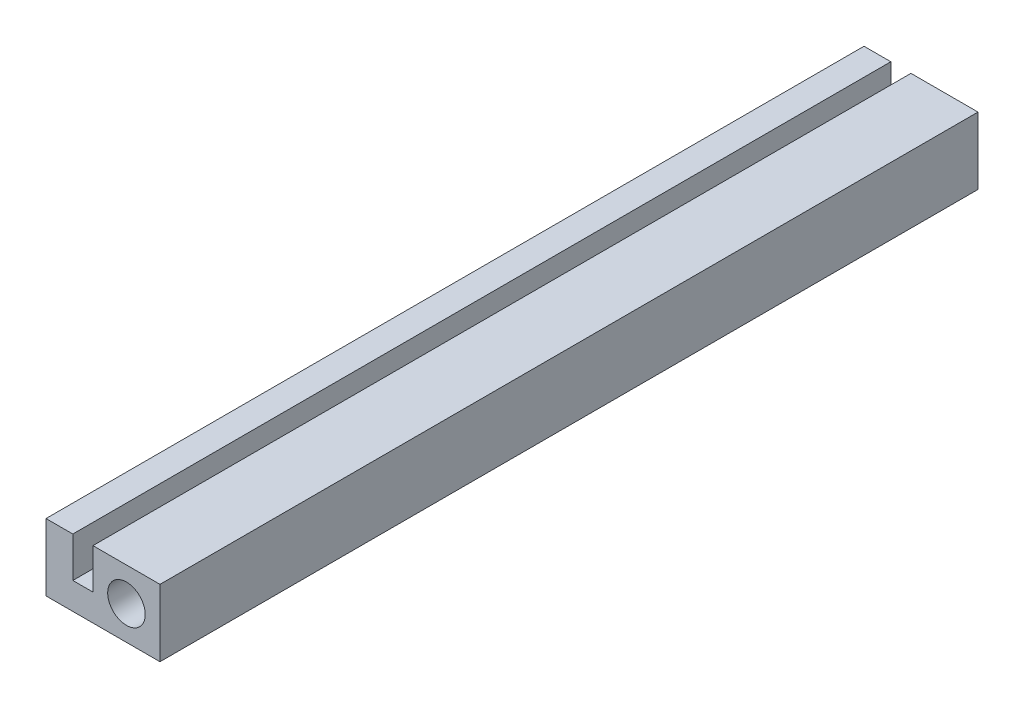
ISO-10303-21;
HEADER;
FILE_DESCRIPTION(('STEP AP214'),'2;1');
FILE_NAME('part.step','',(''),(''),'','','');
FILE_SCHEMA(('AUTOMOTIVE_DESIGN { 1 0 10303 214 1 1 1 1 }'));
ENDSEC;
DATA;
#1=APPLICATION_CONTEXT('core data for automotive mechanical design processes');
#2=APPLICATION_PROTOCOL_DEFINITION('international standard','automotive_design',2000,#1);
#3=PRODUCT_CONTEXT('',#1,'mechanical');
#4=PRODUCT('Part','Part','',(#3));
#5=PRODUCT_RELATED_PRODUCT_CATEGORY('part','',(#4));
#6=PRODUCT_DEFINITION_FORMATION('','',#4);
#7=PRODUCT_DEFINITION_CONTEXT('part definition',#1,'design');
#8=PRODUCT_DEFINITION('design','',#6,#7);
#9=PRODUCT_DEFINITION_SHAPE('','',#8);
#10=(LENGTH_UNIT() NAMED_UNIT(*) SI_UNIT(.MILLI.,.METRE.));
#11=(NAMED_UNIT(*) PLANE_ANGLE_UNIT() SI_UNIT($,.RADIAN.));
#12=(NAMED_UNIT(*) SI_UNIT($,.STERADIAN.) SOLID_ANGLE_UNIT());
#13=UNCERTAINTY_MEASURE_WITH_UNIT(LENGTH_MEASURE(1.E-05),#10,'distance_accuracy_value','');
#14=(GEOMETRIC_REPRESENTATION_CONTEXT(3) GLOBAL_UNCERTAINTY_ASSIGNED_CONTEXT((#13)) GLOBAL_UNIT_ASSIGNED_CONTEXT((#10,
#11,#12)) REPRESENTATION_CONTEXT('',''));
#15=CARTESIAN_POINT('',(0.,0.,0.));
#16=DIRECTION('',(0.,0.,1.));
#17=DIRECTION('',(1.,0.,0.));
#18=AXIS2_PLACEMENT_3D('',#15,#16,#17);
#19=CARTESIAN_POINT('',(0.,0.,122.));
#20=DIRECTION('',(0.,0.,1.));
#21=DIRECTION('',(1.,0.,0.));
#22=AXIS2_PLACEMENT_3D('',#19,#20,#21);
#23=PLANE('',#22);
#24=DIRECTION('',(-1.,0.,0.));
#25=VECTOR('',#24,1.);
#26=CARTESIAN_POINT('',(-2.6767397699127,2.93705011184856,122.));
#27=LINE('',#26,#25);
#28=CARTESIAN_POINT('',(-2.6767397699127,2.93705011184856,122.));
#29=VERTEX_POINT('',#28);
#30=CARTESIAN_POINT('',(-6.6767397699127,2.93705011184857,122.));
#31=VERTEX_POINT('',#30);
#32=EDGE_CURVE('E151',#29,#31,#27,.T.);
#33=ORIENTED_EDGE('',*,*,#32,.T.);
#34=DIRECTION('',(0.,-1.,0.));
#35=VECTOR('',#34,1.);
#36=CARTESIAN_POINT('',(-6.6767397699127,2.93705011184857,122.));
#37=LINE('',#36,#35);
#38=CARTESIAN_POINT('',(-6.6767397699127,-7.06294988815141,122.));
#39=VERTEX_POINT('',#38);
#40=EDGE_CURVE('E99',#31,#39,#37,.T.);
#41=ORIENTED_EDGE('',*,*,#40,.T.);
#42=DIRECTION('',(1.,0.,0.));
#43=VECTOR('',#42,1.);
#44=CARTESIAN_POINT('',(-6.6767397699127,-7.06294988815141,122.));
#45=LINE('',#44,#43);
#46=CARTESIAN_POINT('',(10.3232602300873,-7.06294988815139,122.));
#47=VERTEX_POINT('',#46);
#48=EDGE_CURVE('E166',#39,#47,#45,.T.);
#49=ORIENTED_EDGE('',*,*,#48,.T.);
#50=DIRECTION('',(0.,1.,0.));
#51=VECTOR('',#50,1.);
#52=CARTESIAN_POINT('',(10.3232602300873,-7.06294988815139,122.));
#53=LINE('',#52,#51);
#54=CARTESIAN_POINT('',(10.3232602300873,2.93705011184856,122.));
#55=VERTEX_POINT('',#54);
#56=EDGE_CURVE('E179',#47,#55,#53,.T.);
#57=ORIENTED_EDGE('',*,*,#56,.T.);
#58=DIRECTION('',(-1.,0.,0.));
#59=VECTOR('',#58,1.);
#60=CARTESIAN_POINT('',(10.3232602300873,2.93705011184856,122.));
#61=LINE('',#60,#59);
#62=CARTESIAN_POINT('',(0.323260230087299,2.93705011184856,122.));
#63=VERTEX_POINT('',#62);
#64=EDGE_CURVE('E118',#55,#63,#61,.T.);
#65=ORIENTED_EDGE('',*,*,#64,.T.);
#66=DIRECTION('',(0.,-1.,0.));
#67=VECTOR('',#66,1.);
#68=CARTESIAN_POINT('',(0.323260230087299,2.93705011184856,122.));
#69=LINE('',#68,#67);
#70=CARTESIAN_POINT('',(0.323260230087299,-3.06294988815136,122.));
#71=VERTEX_POINT('',#70);
#72=EDGE_CURVE('E112',#63,#71,#69,.T.);
#73=ORIENTED_EDGE('',*,*,#72,.T.);
#74=DIRECTION('',(-1.,0.,0.));
#75=VECTOR('',#74,1.);
#76=CARTESIAN_POINT('',(0.323260230087299,-3.06294988815136,122.));
#77=LINE('',#76,#75);
#78=CARTESIAN_POINT('',(-2.6767397699127,-3.06294988815136,122.));
#79=VERTEX_POINT('',#78);
#80=EDGE_CURVE('E116',#71,#79,#77,.T.);
#81=ORIENTED_EDGE('',*,*,#80,.T.);
#82=DIRECTION('',(0.,1.,0.));
#83=VECTOR('',#82,1.);
#84=CARTESIAN_POINT('',(-2.6767397699127,-3.06294988815136,122.));
#85=LINE('',#84,#83);
#86=EDGE_CURVE('E56',#79,#29,#85,.T.);
#87=ORIENTED_EDGE('',*,*,#86,.T.);
#88=EDGE_LOOP('',(#33,#41,#49,#57,#65,#73,#81,#87));
#89=FACE_BOUND('',#88,.T.);
#90=CARTESIAN_POINT('',(5.3232602300873,-2.06294988815142,122.));
#91=DIRECTION('',(0.,0.,1.));
#92=DIRECTION('',(1.,0.,0.));
#93=AXIS2_PLACEMENT_3D('',#90,#91,#92);
#94=CIRCLE('',#93,2.8);
#95=CARTESIAN_POINT('',(8.1232602300873,-2.06294988815142,122.));
#96=VERTEX_POINT('',#95);
#97=EDGE_CURVE('E140',#96,#96,#94,.T.);
#98=ORIENTED_EDGE('',*,*,#97,.F.);
#99=EDGE_LOOP('',(#98));
#100=FACE_BOUND('',#99,.T.);
#101=ADVANCED_FACE('F39',(#89,#100),#23,.T.);
#102=CARTESIAN_POINT('',(0.,0.,0.));
#103=DIRECTION('',(0.,0.,1.));
#104=DIRECTION('',(1.,0.,0.));
#105=AXIS2_PLACEMENT_3D('',#102,#103,#104);
#106=PLANE('',#105);
#107=DIRECTION('',(-1.,0.,0.));
#108=VECTOR('',#107,1.);
#109=CARTESIAN_POINT('',(-2.6767397699127,2.93705011184856,0.));
#110=LINE('',#109,#108);
#111=CARTESIAN_POINT('',(-2.6767397699127,2.93705011184856,0.));
#112=VERTEX_POINT('',#111);
#113=CARTESIAN_POINT('',(-6.6767397699127,2.93705011184857,0.));
#114=VERTEX_POINT('',#113);
#115=EDGE_CURVE('E136',#112,#114,#110,.T.);
#116=ORIENTED_EDGE('',*,*,#115,.F.);
#117=DIRECTION('',(0.,1.,0.));
#118=VECTOR('',#117,1.);
#119=CARTESIAN_POINT('',(-2.6767397699127,-3.06294988815136,0.));
#120=LINE('',#119,#118);
#121=CARTESIAN_POINT('',(-2.6767397699127,-3.06294988815136,0.));
#122=VERTEX_POINT('',#121);
#123=EDGE_CURVE('E91',#122,#112,#120,.T.);
#124=ORIENTED_EDGE('',*,*,#123,.F.);
#125=DIRECTION('',(-1.,0.,0.));
#126=VECTOR('',#125,1.);
#127=CARTESIAN_POINT('',(0.323260230087299,-3.06294988815136,0.));
#128=LINE('',#127,#126);
#129=CARTESIAN_POINT('',(0.323260230087299,-3.06294988815136,0.));
#130=VERTEX_POINT('',#129);
#131=EDGE_CURVE('E85',#130,#122,#128,.T.);
#132=ORIENTED_EDGE('',*,*,#131,.F.);
#133=DIRECTION('',(0.,-1.,0.));
#134=VECTOR('',#133,1.);
#135=CARTESIAN_POINT('',(0.323260230087299,2.93705011184856,0.));
#136=LINE('',#135,#134);
#137=CARTESIAN_POINT('',(0.323260230087299,2.93705011184856,0.));
#138=VERTEX_POINT('',#137);
#139=EDGE_CURVE('E126',#138,#130,#136,.T.);
#140=ORIENTED_EDGE('',*,*,#139,.F.);
#141=DIRECTION('',(-1.,0.,0.));
#142=VECTOR('',#141,1.);
#143=CARTESIAN_POINT('',(10.3232602300873,2.93705011184856,0.));
#144=LINE('',#143,#142);
#145=CARTESIAN_POINT('',(10.3232602300873,2.93705011184856,0.));
#146=VERTEX_POINT('',#145);
#147=EDGE_CURVE('E146',#146,#138,#144,.T.);
#148=ORIENTED_EDGE('',*,*,#147,.F.);
#149=DIRECTION('',(0.,1.,0.));
#150=VECTOR('',#149,1.);
#151=CARTESIAN_POINT('',(10.3232602300873,-7.06294988815139,0.));
#152=LINE('',#151,#150);
#153=CARTESIAN_POINT('',(10.3232602300873,-7.06294988815139,0.));
#154=VERTEX_POINT('',#153);
#155=EDGE_CURVE('E144',#154,#146,#152,.T.);
#156=ORIENTED_EDGE('',*,*,#155,.F.);
#157=DIRECTION('',(1.,0.,0.));
#158=VECTOR('',#157,1.);
#159=CARTESIAN_POINT('',(-6.6767397699127,-7.06294988815141,0.));
#160=LINE('',#159,#158);
#161=CARTESIAN_POINT('',(-6.6767397699127,-7.06294988815141,0.));
#162=VERTEX_POINT('',#161);
#163=EDGE_CURVE('E142',#162,#154,#160,.T.);
#164=ORIENTED_EDGE('',*,*,#163,.F.);
#165=DIRECTION('',(0.,-1.,0.));
#166=VECTOR('',#165,1.);
#167=CARTESIAN_POINT('',(-6.6767397699127,2.93705011184857,0.));
#168=LINE('',#167,#166);
#169=EDGE_CURVE('E139',#114,#162,#168,.T.);
#170=ORIENTED_EDGE('',*,*,#169,.F.);
#171=EDGE_LOOP('',(#116,#124,#132,#140,#148,#156,#164,#170));
#172=FACE_BOUND('',#171,.T.);
#173=CARTESIAN_POINT('',(5.3232602300873,-2.06294988815142,0.));
#174=DIRECTION('',(0.,0.,1.));
#175=DIRECTION('',(1.,0.,0.));
#176=AXIS2_PLACEMENT_3D('',#173,#174,#175);
#177=CIRCLE('',#176,2.8);
#178=CARTESIAN_POINT('',(8.1232602300873,-2.06294988815142,0.));
#179=VERTEX_POINT('',#178);
#180=EDGE_CURVE('E185',#179,#179,#177,.T.);
#181=ORIENTED_EDGE('',*,*,#180,.T.);
#182=EDGE_LOOP('',(#181));
#183=FACE_BOUND('',#182,.T.);
#184=ADVANCED_FACE('F170',(#172,#183),#106,.F.);
#185=CARTESIAN_POINT('',(-2.6767397699127,2.93705011184856,122.));
#186=DIRECTION('',(0.,-1.,0.));
#187=DIRECTION('',(1.,0.,0.));
#188=AXIS2_PLACEMENT_3D('',#185,#186,#187);
#189=PLANE('',#188);
#190=ORIENTED_EDGE('',*,*,#115,.T.);
#191=DIRECTION('',(0.,0.,-1.));
#192=VECTOR('',#191,1.);
#193=CARTESIAN_POINT('',(-6.6767397699127,2.93705011184857,122.));
#194=LINE('',#193,#192);
#195=EDGE_CURVE('E11',#31,#114,#194,.T.);
#196=ORIENTED_EDGE('',*,*,#195,.F.);
#197=ORIENTED_EDGE('',*,*,#32,.F.);
#198=DIRECTION('',(0.,0.,-1.));
#199=VECTOR('',#198,1.);
#200=CARTESIAN_POINT('',(-2.6767397699127,2.93705011184856,122.));
#201=LINE('',#200,#199);
#202=EDGE_CURVE('E132',#29,#112,#201,.T.);
#203=ORIENTED_EDGE('',*,*,#202,.T.);
#204=EDGE_LOOP('',(#190,#196,#197,#203));
#205=FACE_BOUND('',#204,.T.);
#206=ADVANCED_FACE('F41',(#205),#189,.F.);
#207=CARTESIAN_POINT('',(-6.6767397699127,2.93705011184857,122.));
#208=DIRECTION('',(1.,0.,0.));
#209=DIRECTION('',(0.,0.,-1.));
#210=AXIS2_PLACEMENT_3D('',#207,#208,#209);
#211=PLANE('',#210);
#212=ORIENTED_EDGE('',*,*,#169,.T.);
#213=DIRECTION('',(0.,0.,-1.));
#214=VECTOR('',#213,1.);
#215=CARTESIAN_POINT('',(-6.6767397699127,-7.06294988815141,122.));
#216=LINE('',#215,#214);
#217=EDGE_CURVE('E48',#39,#162,#216,.T.);
#218=ORIENTED_EDGE('',*,*,#217,.F.);
#219=ORIENTED_EDGE('',*,*,#40,.F.);
#220=ORIENTED_EDGE('',*,*,#195,.T.);
#221=EDGE_LOOP('',(#212,#218,#219,#220));
#222=FACE_BOUND('',#221,.T.);
#223=ADVANCED_FACE('F213',(#222),#211,.F.);
#224=CARTESIAN_POINT('',(-6.6767397699127,-7.06294988815141,122.));
#225=DIRECTION('',(0.,1.,0.));
#226=DIRECTION('',(-1.,0.,0.));
#227=AXIS2_PLACEMENT_3D('',#224,#225,#226);
#228=PLANE('',#227);
#229=ORIENTED_EDGE('',*,*,#163,.T.);
#230=DIRECTION('',(0.,0.,-1.));
#231=VECTOR('',#230,1.);
#232=CARTESIAN_POINT('',(10.3232602300873,-7.06294988815139,122.));
#233=LINE('',#232,#231);
#234=EDGE_CURVE('E158',#47,#154,#233,.T.);
#235=ORIENTED_EDGE('',*,*,#234,.F.);
#236=ORIENTED_EDGE('',*,*,#48,.F.);
#237=ORIENTED_EDGE('',*,*,#217,.T.);
#238=EDGE_LOOP('',(#229,#235,#236,#237));
#239=FACE_BOUND('',#238,.T.);
#240=ADVANCED_FACE('F164',(#239),#228,.F.);
#241=CARTESIAN_POINT('',(10.3232602300873,-7.06294988815139,122.));
#242=DIRECTION('',(-1.,0.,0.));
#243=DIRECTION('',(0.,0.,1.));
#244=AXIS2_PLACEMENT_3D('',#241,#242,#243);
#245=PLANE('',#244);
#246=ORIENTED_EDGE('',*,*,#155,.T.);
#247=DIRECTION('',(0.,0.,-1.));
#248=VECTOR('',#247,1.);
#249=CARTESIAN_POINT('',(10.3232602300873,2.93705011184856,122.));
#250=LINE('',#249,#248);
#251=EDGE_CURVE('E155',#55,#146,#250,.T.);
#252=ORIENTED_EDGE('',*,*,#251,.F.);
#253=ORIENTED_EDGE('',*,*,#56,.F.);
#254=ORIENTED_EDGE('',*,*,#234,.T.);
#255=EDGE_LOOP('',(#246,#252,#253,#254));
#256=FACE_BOUND('',#255,.T.);
#257=ADVANCED_FACE('F175',(#256),#245,.F.);
#258=CARTESIAN_POINT('',(10.3232602300873,2.93705011184856,122.));
#259=DIRECTION('',(0.,-1.,0.));
#260=DIRECTION('',(0.,0.,-1.));
#261=AXIS2_PLACEMENT_3D('',#258,#259,#260);
#262=PLANE('',#261);
#263=ORIENTED_EDGE('',*,*,#147,.T.);
#264=DIRECTION('',(0.,0.,-1.));
#265=VECTOR('',#264,1.);
#266=CARTESIAN_POINT('',(0.323260230087299,2.93705011184856,122.));
#267=LINE('',#266,#265);
#268=EDGE_CURVE('E127',#63,#138,#267,.T.);
#269=ORIENTED_EDGE('',*,*,#268,.F.);
#270=ORIENTED_EDGE('',*,*,#64,.F.);
#271=ORIENTED_EDGE('',*,*,#251,.T.);
#272=EDGE_LOOP('',(#263,#269,#270,#271));
#273=FACE_BOUND('',#272,.T.);
#274=ADVANCED_FACE('F178',(#273),#262,.F.);
#275=CARTESIAN_POINT('',(0.323260230087299,2.93705011184856,122.));
#276=DIRECTION('',(1.,0.,0.));
#277=DIRECTION('',(0.,1.,0.));
#278=AXIS2_PLACEMENT_3D('',#275,#276,#277);
#279=PLANE('',#278);
#280=ORIENTED_EDGE('',*,*,#139,.T.);
#281=DIRECTION('',(0.,0.,-1.));
#282=VECTOR('',#281,1.);
#283=CARTESIAN_POINT('',(0.323260230087299,-3.06294988815136,122.));
#284=LINE('',#283,#282);
#285=EDGE_CURVE('E123',#71,#130,#284,.T.);
#286=ORIENTED_EDGE('',*,*,#285,.F.);
#287=ORIENTED_EDGE('',*,*,#72,.F.);
#288=ORIENTED_EDGE('',*,*,#268,.T.);
#289=EDGE_LOOP('',(#280,#286,#287,#288));
#290=FACE_BOUND('',#289,.T.);
#291=ADVANCED_FACE('F124',(#290),#279,.F.);
#292=CARTESIAN_POINT('',(0.323260230087299,-3.06294988815136,122.));
#293=DIRECTION('',(0.,-1.,0.));
#294=DIRECTION('',(0.,0.,-1.));
#295=AXIS2_PLACEMENT_3D('',#292,#293,#294);
#296=PLANE('',#295);
#297=ORIENTED_EDGE('',*,*,#131,.T.);
#298=DIRECTION('',(0.,0.,-1.));
#299=VECTOR('',#298,1.);
#300=CARTESIAN_POINT('',(-2.6767397699127,-3.06294988815136,122.));
#301=LINE('',#300,#299);
#302=EDGE_CURVE('E128',#79,#122,#301,.T.);
#303=ORIENTED_EDGE('',*,*,#302,.F.);
#304=ORIENTED_EDGE('',*,*,#80,.F.);
#305=ORIENTED_EDGE('',*,*,#285,.T.);
#306=EDGE_LOOP('',(#297,#303,#304,#305));
#307=FACE_BOUND('',#306,.T.);
#308=ADVANCED_FACE('F130',(#307),#296,.F.);
#309=CARTESIAN_POINT('',(-2.6767397699127,-3.06294988815136,122.));
#310=DIRECTION('',(-1.,0.,0.));
#311=DIRECTION('',(0.,0.,1.));
#312=AXIS2_PLACEMENT_3D('',#309,#310,#311);
#313=PLANE('',#312);
#314=ORIENTED_EDGE('',*,*,#123,.T.);
#315=ORIENTED_EDGE('',*,*,#202,.F.);
#316=ORIENTED_EDGE('',*,*,#86,.F.);
#317=ORIENTED_EDGE('',*,*,#302,.T.);
#318=EDGE_LOOP('',(#314,#315,#316,#317));
#319=FACE_BOUND('',#318,.T.);
#320=ADVANCED_FACE('F201',(#319),#313,.F.);
#321=CARTESIAN_POINT('',(5.3232602300873,-2.06294988815142,122.));
#322=DIRECTION('',(0.,0.,-1.));
#323=DIRECTION('',(-1.,0.,0.));
#324=AXIS2_PLACEMENT_3D('',#321,#322,#323);
#325=CYLINDRICAL_SURFACE('',#324,2.8);
#326=ORIENTED_EDGE('',*,*,#97,.T.);
#327=EDGE_LOOP('',(#326));
#328=FACE_BOUND('',#327,.T.);
#329=ORIENTED_EDGE('',*,*,#180,.F.);
#330=EDGE_LOOP('',(#329));
#331=FACE_BOUND('',#330,.T.);
#332=ADVANCED_FACE('F191',(#328,#331),#325,.F.);
#333=CLOSED_SHELL('',(#101,#184,#206,#223,#240,#257,#274,#291,#308,#320,#332));
#334=MANIFOLD_SOLID_BREP('B2',#333);
#335=ADVANCED_BREP_SHAPE_REPRESENTATION('',(#18,#334),#14);
#336=SHAPE_DEFINITION_REPRESENTATION(#9,#335);
ENDSEC;
END-ISO-10303-21;
